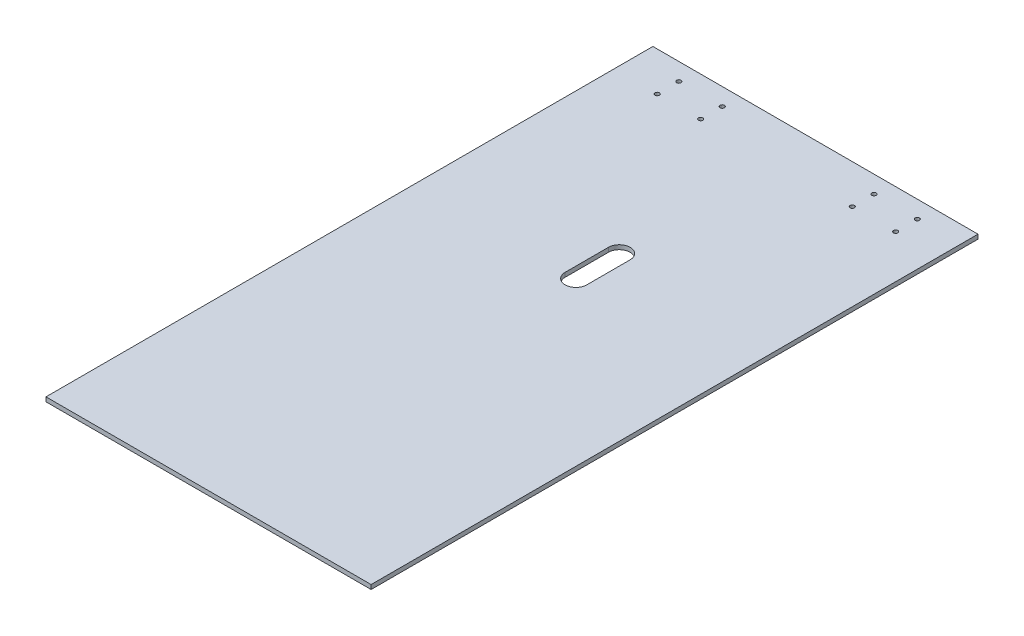
ISO-10303-21;
HEADER;
FILE_DESCRIPTION(('STEP AP214'),'2;1');
FILE_NAME('part.step','',(''),(''),'','','');
FILE_SCHEMA(('AUTOMOTIVE_DESIGN { 1 0 10303 214 1 1 1 1 }'));
ENDSEC;
DATA;
#1=APPLICATION_CONTEXT('core data for automotive mechanical design processes');
#2=APPLICATION_PROTOCOL_DEFINITION('international standard','automotive_design',2000,#1);
#3=PRODUCT_CONTEXT('',#1,'mechanical');
#4=PRODUCT('Part','Part','',(#3));
#5=PRODUCT_RELATED_PRODUCT_CATEGORY('part','',(#4));
#6=PRODUCT_DEFINITION_FORMATION('','',#4);
#7=PRODUCT_DEFINITION_CONTEXT('part definition',#1,'design');
#8=PRODUCT_DEFINITION('design','',#6,#7);
#9=PRODUCT_DEFINITION_SHAPE('','',#8);
#10=(LENGTH_UNIT() NAMED_UNIT(*) SI_UNIT(.MILLI.,.METRE.));
#11=(NAMED_UNIT(*) PLANE_ANGLE_UNIT() SI_UNIT($,.RADIAN.));
#12=(NAMED_UNIT(*) SI_UNIT($,.STERADIAN.) SOLID_ANGLE_UNIT());
#13=UNCERTAINTY_MEASURE_WITH_UNIT(LENGTH_MEASURE(1.E-05),#10,'distance_accuracy_value','');
#14=(GEOMETRIC_REPRESENTATION_CONTEXT(3) GLOBAL_UNCERTAINTY_ASSIGNED_CONTEXT((#13)) GLOBAL_UNIT_ASSIGNED_CONTEXT((#10,
#11,#12)) REPRESENTATION_CONTEXT('',''));
#15=CARTESIAN_POINT('',(0.,0.,0.));
#16=DIRECTION('',(0.,0.,1.));
#17=DIRECTION('',(1.,0.,0.));
#18=AXIS2_PLACEMENT_3D('',#15,#16,#17);
#19=CARTESIAN_POINT('',(-35.,-0.00100000000000013,-122.));
#20=DIRECTION('',(0.,1.,0.));
#21=DIRECTION('',(0.,0.,1.));
#22=AXIS2_PLACEMENT_3D('',#19,#20,#21);
#23=CYLINDRICAL_SURFACE('',#22,0.999999999999998);
#24=CARTESIAN_POINT('',(-35.,2.,-122.));
#25=DIRECTION('',(0.,1.,0.));
#26=DIRECTION('',(0.,0.,1.));
#27=AXIS2_PLACEMENT_3D('',#24,#25,#26);
#28=CIRCLE('',#27,0.999999999999998);
#29=CARTESIAN_POINT('',(-35.,2.,-121.));
#30=VERTEX_POINT('',#29);
#31=EDGE_CURVE('E198',#30,#30,#28,.T.);
#32=ORIENTED_EDGE('',*,*,#31,.T.);
#33=EDGE_LOOP('',(#32));
#34=FACE_BOUND('',#33,.T.);
#35=CARTESIAN_POINT('',(-35.,0.,-122.));
#36=DIRECTION('',(0.,1.,0.));
#37=DIRECTION('',(0.,0.,1.));
#38=AXIS2_PLACEMENT_3D('',#35,#36,#37);
#39=CIRCLE('',#38,0.999999999999998);
#40=CARTESIAN_POINT('',(-35.,0.,-121.));
#41=VERTEX_POINT('',#40);
#42=EDGE_CURVE('E201',#41,#41,#39,.F.);
#43=ORIENTED_EDGE('',*,*,#42,.T.);
#44=EDGE_LOOP('',(#43));
#45=FACE_BOUND('',#44,.T.);
#46=ADVANCED_FACE('F34',(#34,#45),#23,.F.);
#47=CARTESIAN_POINT('',(-55.,-0.00100000000000013,-122.));
#48=DIRECTION('',(0.,1.,0.));
#49=DIRECTION('',(0.,0.,1.));
#50=AXIS2_PLACEMENT_3D('',#47,#48,#49);
#51=CYLINDRICAL_SURFACE('',#50,0.999999999999998);
#52=CARTESIAN_POINT('',(-55.,2.,-122.));
#53=DIRECTION('',(0.,1.,0.));
#54=DIRECTION('',(0.,0.,1.));
#55=AXIS2_PLACEMENT_3D('',#52,#53,#54);
#56=CIRCLE('',#55,0.999999999999998);
#57=CARTESIAN_POINT('',(-55.,2.,-121.));
#58=VERTEX_POINT('',#57);
#59=EDGE_CURVE('E192',#58,#58,#56,.T.);
#60=ORIENTED_EDGE('',*,*,#59,.T.);
#61=EDGE_LOOP('',(#60));
#62=FACE_BOUND('',#61,.T.);
#63=CARTESIAN_POINT('',(-55.,0.,-122.));
#64=DIRECTION('',(0.,1.,0.));
#65=DIRECTION('',(0.,0.,1.));
#66=AXIS2_PLACEMENT_3D('',#63,#64,#65);
#67=CIRCLE('',#66,0.999999999999998);
#68=CARTESIAN_POINT('',(-55.,0.,-121.));
#69=VERTEX_POINT('',#68);
#70=EDGE_CURVE('E195',#69,#69,#67,.F.);
#71=ORIENTED_EDGE('',*,*,#70,.T.);
#72=EDGE_LOOP('',(#71));
#73=FACE_BOUND('',#72,.T.);
#74=ADVANCED_FACE('F227',(#62,#73),#51,.F.);
#75=CARTESIAN_POINT('',(75.,2.,-140.));
#76=DIRECTION('',(-1.,0.,0.));
#77=DIRECTION('',(0.,0.,1.));
#78=AXIS2_PLACEMENT_3D('',#75,#76,#77);
#79=PLANE('',#78);
#80=DIRECTION('',(0.,0.,-1.));
#81=VECTOR('',#80,1.);
#82=CARTESIAN_POINT('',(75.,0.,-140.));
#83=LINE('',#82,#81);
#84=CARTESIAN_POINT('',(75.,0.,140.));
#85=VERTEX_POINT('',#84);
#86=CARTESIAN_POINT('',(75.,0.,-140.));
#87=VERTEX_POINT('',#86);
#88=EDGE_CURVE('E162',#85,#87,#83,.T.);
#89=ORIENTED_EDGE('',*,*,#88,.T.);
#90=DIRECTION('',(0.,-1.,0.));
#91=VECTOR('',#90,1.);
#92=CARTESIAN_POINT('',(75.,2.,-140.));
#93=LINE('',#92,#91);
#94=CARTESIAN_POINT('',(75.,2.,-140.));
#95=VERTEX_POINT('',#94);
#96=EDGE_CURVE('E189',#95,#87,#93,.T.);
#97=ORIENTED_EDGE('',*,*,#96,.F.);
#98=DIRECTION('',(0.,0.,-1.));
#99=VECTOR('',#98,1.);
#100=CARTESIAN_POINT('',(75.,2.,-140.));
#101=LINE('',#100,#99);
#102=CARTESIAN_POINT('',(75.,2.,140.));
#103=VERTEX_POINT('',#102);
#104=EDGE_CURVE('E163',#103,#95,#101,.T.);
#105=ORIENTED_EDGE('',*,*,#104,.F.);
#106=DIRECTION('',(0.,-1.,0.));
#107=VECTOR('',#106,1.);
#108=CARTESIAN_POINT('',(75.,2.,140.));
#109=LINE('',#108,#107);
#110=EDGE_CURVE('E173',#103,#85,#109,.T.);
#111=ORIENTED_EDGE('',*,*,#110,.T.);
#112=EDGE_LOOP('',(#89,#97,#105,#111));
#113=FACE_BOUND('',#112,.T.);
#114=ADVANCED_FACE('F232',(#113),#79,.F.);
#115=CARTESIAN_POINT('',(-75.,2.,-140.));
#116=DIRECTION('',(0.,0.,1.));
#117=DIRECTION('',(1.,0.,0.));
#118=AXIS2_PLACEMENT_3D('',#115,#116,#117);
#119=PLANE('',#118);
#120=DIRECTION('',(-1.,0.,0.));
#121=VECTOR('',#120,1.);
#122=CARTESIAN_POINT('',(-75.,0.,-140.));
#123=LINE('',#122,#121);
#124=CARTESIAN_POINT('',(-75.,0.,-140.));
#125=VERTEX_POINT('',#124);
#126=EDGE_CURVE('E176',#87,#125,#123,.T.);
#127=ORIENTED_EDGE('',*,*,#126,.T.);
#128=DIRECTION('',(0.,-1.,0.));
#129=VECTOR('',#128,1.);
#130=CARTESIAN_POINT('',(-75.,2.,-140.));
#131=LINE('',#130,#129);
#132=CARTESIAN_POINT('',(-75.,2.,-140.));
#133=VERTEX_POINT('',#132);
#134=EDGE_CURVE('E186',#133,#125,#131,.T.);
#135=ORIENTED_EDGE('',*,*,#134,.F.);
#136=DIRECTION('',(-1.,0.,0.));
#137=VECTOR('',#136,1.);
#138=CARTESIAN_POINT('',(-75.,2.,-140.));
#139=LINE('',#138,#137);
#140=EDGE_CURVE('E166',#95,#133,#139,.T.);
#141=ORIENTED_EDGE('',*,*,#140,.F.);
#142=ORIENTED_EDGE('',*,*,#96,.T.);
#143=EDGE_LOOP('',(#127,#135,#141,#142));
#144=FACE_BOUND('',#143,.T.);
#145=ADVANCED_FACE('F257',(#144),#119,.F.);
#146=CARTESIAN_POINT('',(-75.,2.,-140.));
#147=DIRECTION('',(1.,0.,0.));
#148=DIRECTION('',(0.,0.,-1.));
#149=AXIS2_PLACEMENT_3D('',#146,#147,#148);
#150=PLANE('',#149);
#151=DIRECTION('',(0.,0.,1.));
#152=VECTOR('',#151,1.);
#153=CARTESIAN_POINT('',(-75.,0.,-140.));
#154=LINE('',#153,#152);
#155=CARTESIAN_POINT('',(-75.,0.,140.));
#156=VERTEX_POINT('',#155);
#157=EDGE_CURVE('E178',#125,#156,#154,.T.);
#158=ORIENTED_EDGE('',*,*,#157,.T.);
#159=DIRECTION('',(0.,-1.,0.));
#160=VECTOR('',#159,1.);
#161=CARTESIAN_POINT('',(-75.,2.,140.));
#162=LINE('',#161,#160);
#163=CARTESIAN_POINT('',(-75.,2.,140.));
#164=VERTEX_POINT('',#163);
#165=EDGE_CURVE('E183',#164,#156,#162,.T.);
#166=ORIENTED_EDGE('',*,*,#165,.F.);
#167=DIRECTION('',(0.,0.,1.));
#168=VECTOR('',#167,1.);
#169=CARTESIAN_POINT('',(-75.,2.,-140.));
#170=LINE('',#169,#168);
#171=EDGE_CURVE('E169',#133,#164,#170,.T.);
#172=ORIENTED_EDGE('',*,*,#171,.F.);
#173=ORIENTED_EDGE('',*,*,#134,.T.);
#174=EDGE_LOOP('',(#158,#166,#172,#173));
#175=FACE_BOUND('',#174,.T.);
#176=ADVANCED_FACE('F253',(#175),#150,.F.);
#177=CARTESIAN_POINT('',(-75.,2.,140.));
#178=DIRECTION('',(0.,0.,-1.));
#179=DIRECTION('',(-1.,0.,0.));
#180=AXIS2_PLACEMENT_3D('',#177,#178,#179);
#181=PLANE('',#180);
#182=DIRECTION('',(1.,0.,0.));
#183=VECTOR('',#182,1.);
#184=CARTESIAN_POINT('',(-75.,0.,140.));
#185=LINE('',#184,#183);
#186=EDGE_CURVE('E167',#156,#85,#185,.T.);
#187=ORIENTED_EDGE('',*,*,#186,.T.);
#188=ORIENTED_EDGE('',*,*,#110,.F.);
#189=DIRECTION('',(1.,0.,0.));
#190=VECTOR('',#189,1.);
#191=CARTESIAN_POINT('',(-75.,2.,140.));
#192=LINE('',#191,#190);
#193=EDGE_CURVE('E171',#164,#103,#192,.T.);
#194=ORIENTED_EDGE('',*,*,#193,.F.);
#195=ORIENTED_EDGE('',*,*,#165,.T.);
#196=EDGE_LOOP('',(#187,#188,#194,#195));
#197=FACE_BOUND('',#196,.T.);
#198=ADVANCED_FACE('F248',(#197),#181,.F.);
#199=CARTESIAN_POINT('',(0.,2.,0.));
#200=DIRECTION('',(0.,1.,0.));
#201=DIRECTION('',(0.,0.,1.));
#202=AXIS2_PLACEMENT_3D('',#199,#200,#201);
#203=PLANE('',#202);
#204=CARTESIAN_POINT('',(0.,2.,-29.5));
#205=DIRECTION('',(0.,1.,0.));
#206=DIRECTION('',(0.,0.,1.));
#207=AXIS2_PLACEMENT_3D('',#204,#205,#206);
#208=CIRCLE('',#207,5.);
#209=CARTESIAN_POINT('',(-4.99999999999995,2.,-29.5));
#210=VERTEX_POINT('',#209);
#211=CARTESIAN_POINT('',(5.00000000000005,2.,-29.5));
#212=VERTEX_POINT('',#211);
#213=EDGE_CURVE('E48',#210,#212,#208,.T.);
#214=ORIENTED_EDGE('',*,*,#213,.F.);
#215=DIRECTION('',(0.,0.,1.));
#216=VECTOR('',#215,1.);
#217=CARTESIAN_POINT('',(-4.99999999999996,2.,-49.5));
#218=LINE('',#217,#216);
#219=CARTESIAN_POINT('',(-4.99999999999996,2.,-49.5));
#220=VERTEX_POINT('',#219);
#221=EDGE_CURVE('E117',#220,#210,#218,.T.);
#222=ORIENTED_EDGE('',*,*,#221,.F.);
#223=CARTESIAN_POINT('',(0.,2.,-49.5));
#224=DIRECTION('',(0.,1.,0.));
#225=DIRECTION('',(0.,0.,1.));
#226=AXIS2_PLACEMENT_3D('',#223,#224,#225);
#227=CIRCLE('',#226,5.);
#228=CARTESIAN_POINT('',(5.00000000000004,2.,-49.5));
#229=VERTEX_POINT('',#228);
#230=EDGE_CURVE('E101',#229,#220,#227,.T.);
#231=ORIENTED_EDGE('',*,*,#230,.F.);
#232=DIRECTION('',(0.,0.,-1.));
#233=VECTOR('',#232,1.);
#234=CARTESIAN_POINT('',(5.00000000000004,2.,-49.5));
#235=LINE('',#234,#233);
#236=EDGE_CURVE('E110',#212,#229,#235,.T.);
#237=ORIENTED_EDGE('',*,*,#236,.F.);
#238=EDGE_LOOP('',(#214,#222,#231,#237));
#239=FACE_BOUND('',#238,.T.);
#240=CARTESIAN_POINT('',(35.,2.,-132.));
#241=DIRECTION('',(0.,-1.,0.));
#242=DIRECTION('',(0.,0.,1.));
#243=AXIS2_PLACEMENT_3D('',#240,#241,#242);
#244=CIRCLE('',#243,0.999999999999998);
#245=CARTESIAN_POINT('',(35.,2.,-131.));
#246=VERTEX_POINT('',#245);
#247=EDGE_CURVE('E127',#246,#246,#244,.T.);
#248=ORIENTED_EDGE('',*,*,#247,.T.);
#249=EDGE_LOOP('',(#248));
#250=FACE_BOUND('',#249,.T.);
#251=CARTESIAN_POINT('',(35.,2.,-122.));
#252=DIRECTION('',(0.,-1.,0.));
#253=DIRECTION('',(0.,0.,1.));
#254=AXIS2_PLACEMENT_3D('',#251,#252,#253);
#255=CIRCLE('',#254,0.999999999999998);
#256=CARTESIAN_POINT('',(35.,2.,-121.));
#257=VERTEX_POINT('',#256);
#258=EDGE_CURVE('E134',#257,#257,#255,.T.);
#259=ORIENTED_EDGE('',*,*,#258,.T.);
#260=EDGE_LOOP('',(#259));
#261=FACE_BOUND('',#260,.T.);
#262=CARTESIAN_POINT('',(55.,2.,-122.));
#263=DIRECTION('',(0.,-1.,0.));
#264=DIRECTION('',(0.,0.,1.));
#265=AXIS2_PLACEMENT_3D('',#262,#263,#264);
#266=CIRCLE('',#265,0.999999999999998);
#267=CARTESIAN_POINT('',(55.,2.,-121.));
#268=VERTEX_POINT('',#267);
#269=EDGE_CURVE('E139',#268,#268,#266,.T.);
#270=ORIENTED_EDGE('',*,*,#269,.T.);
#271=EDGE_LOOP('',(#270));
#272=FACE_BOUND('',#271,.T.);
#273=CARTESIAN_POINT('',(55.,2.,-132.));
#274=DIRECTION('',(0.,-1.,0.));
#275=DIRECTION('',(0.,0.,1.));
#276=AXIS2_PLACEMENT_3D('',#273,#274,#275);
#277=CIRCLE('',#276,0.999999999999998);
#278=CARTESIAN_POINT('',(55.,2.,-131.));
#279=VERTEX_POINT('',#278);
#280=EDGE_CURVE('E145',#279,#279,#277,.T.);
#281=ORIENTED_EDGE('',*,*,#280,.T.);
#282=EDGE_LOOP('',(#281));
#283=FACE_BOUND('',#282,.T.);
#284=CARTESIAN_POINT('',(-35.,2.,-132.));
#285=DIRECTION('',(0.,1.,0.));
#286=DIRECTION('',(0.,0.,1.));
#287=AXIS2_PLACEMENT_3D('',#284,#285,#286);
#288=CIRCLE('',#287,0.999999999999998);
#289=CARTESIAN_POINT('',(-35.,2.,-131.));
#290=VERTEX_POINT('',#289);
#291=EDGE_CURVE('E148',#290,#290,#288,.T.);
#292=ORIENTED_EDGE('',*,*,#291,.F.);
#293=EDGE_LOOP('',(#292));
#294=FACE_BOUND('',#293,.T.);
#295=CARTESIAN_POINT('',(-55.,2.,-132.));
#296=DIRECTION('',(0.,1.,0.));
#297=DIRECTION('',(0.,0.,1.));
#298=AXIS2_PLACEMENT_3D('',#295,#296,#297);
#299=CIRCLE('',#298,0.999999999999998);
#300=CARTESIAN_POINT('',(-55.,2.,-131.));
#301=VERTEX_POINT('',#300);
#302=EDGE_CURVE('E156',#301,#301,#299,.T.);
#303=ORIENTED_EDGE('',*,*,#302,.F.);
#304=EDGE_LOOP('',(#303));
#305=FACE_BOUND('',#304,.T.);
#306=ORIENTED_EDGE('',*,*,#104,.T.);
#307=ORIENTED_EDGE('',*,*,#140,.T.);
#308=ORIENTED_EDGE('',*,*,#171,.T.);
#309=ORIENTED_EDGE('',*,*,#193,.T.);
#310=EDGE_LOOP('',(#306,#307,#308,#309));
#311=FACE_BOUND('',#310,.T.);
#312=ORIENTED_EDGE('',*,*,#59,.F.);
#313=EDGE_LOOP('',(#312));
#314=FACE_BOUND('',#313,.T.);
#315=ORIENTED_EDGE('',*,*,#31,.F.);
#316=EDGE_LOOP('',(#315));
#317=FACE_BOUND('',#316,.T.);
#318=ADVANCED_FACE('F114',(#239,#250,#261,#272,#283,#294,#305,#311,#314,#317),#203,.T.);
#319=CARTESIAN_POINT('',(0.,0.,0.));
#320=DIRECTION('',(0.,1.,0.));
#321=DIRECTION('',(0.,0.,1.));
#322=AXIS2_PLACEMENT_3D('',#319,#320,#321);
#323=PLANE('',#322);
#324=DIRECTION('',(0.,0.,1.));
#325=VECTOR('',#324,1.);
#326=CARTESIAN_POINT('',(-4.99999999999995,0.,0.));
#327=LINE('',#326,#325);
#328=CARTESIAN_POINT('',(-4.99999999999996,0.,-49.5));
#329=VERTEX_POINT('',#328);
#330=CARTESIAN_POINT('',(-4.99999999999995,0.,-29.5));
#331=VERTEX_POINT('',#330);
#332=EDGE_CURVE('E41',#329,#331,#327,.T.);
#333=ORIENTED_EDGE('',*,*,#332,.T.);
#334=CARTESIAN_POINT('',(0.,0.,-29.5));
#335=DIRECTION('',(0.,1.,0.));
#336=DIRECTION('',(0.,0.,1.));
#337=AXIS2_PLACEMENT_3D('',#334,#335,#336);
#338=CIRCLE('',#337,5.);
#339=CARTESIAN_POINT('',(5.00000000000005,0.,-29.5));
#340=VERTEX_POINT('',#339);
#341=EDGE_CURVE('E11',#331,#340,#338,.T.);
#342=ORIENTED_EDGE('',*,*,#341,.T.);
#343=DIRECTION('',(0.,0.,-1.));
#344=VECTOR('',#343,1.);
#345=CARTESIAN_POINT('',(5.00000000000006,0.,0.));
#346=LINE('',#345,#344);
#347=CARTESIAN_POINT('',(5.00000000000004,0.,-49.5));
#348=VERTEX_POINT('',#347);
#349=EDGE_CURVE('E204',#340,#348,#346,.T.);
#350=ORIENTED_EDGE('',*,*,#349,.T.);
#351=CARTESIAN_POINT('',(0.,0.,-49.5));
#352=DIRECTION('',(0.,1.,0.));
#353=DIRECTION('',(0.,0.,1.));
#354=AXIS2_PLACEMENT_3D('',#351,#352,#353);
#355=CIRCLE('',#354,5.);
#356=EDGE_CURVE('E104',#348,#329,#355,.T.);
#357=ORIENTED_EDGE('',*,*,#356,.T.);
#358=EDGE_LOOP('',(#333,#342,#350,#357));
#359=FACE_BOUND('',#358,.T.);
#360=CARTESIAN_POINT('',(35.,0.,-132.));
#361=DIRECTION('',(0.,1.,0.));
#362=DIRECTION('',(0.,0.,1.));
#363=AXIS2_PLACEMENT_3D('',#360,#361,#362);
#364=CIRCLE('',#363,0.999999999999998);
#365=CARTESIAN_POINT('',(35.,0.,-131.));
#366=VERTEX_POINT('',#365);
#367=EDGE_CURVE('E131',#366,#366,#364,.T.);
#368=ORIENTED_EDGE('',*,*,#367,.T.);
#369=EDGE_LOOP('',(#368));
#370=FACE_BOUND('',#369,.T.);
#371=CARTESIAN_POINT('',(35.,0.,-122.));
#372=DIRECTION('',(0.,1.,0.));
#373=DIRECTION('',(0.,0.,1.));
#374=AXIS2_PLACEMENT_3D('',#371,#372,#373);
#375=CIRCLE('',#374,0.999999999999998);
#376=CARTESIAN_POINT('',(35.,0.,-121.));
#377=VERTEX_POINT('',#376);
#378=EDGE_CURVE('E124',#377,#377,#375,.T.);
#379=ORIENTED_EDGE('',*,*,#378,.T.);
#380=EDGE_LOOP('',(#379));
#381=FACE_BOUND('',#380,.T.);
#382=CARTESIAN_POINT('',(55.,0.,-122.));
#383=DIRECTION('',(0.,1.,0.));
#384=DIRECTION('',(0.,0.,1.));
#385=AXIS2_PLACEMENT_3D('',#382,#383,#384);
#386=CIRCLE('',#385,0.999999999999998);
#387=CARTESIAN_POINT('',(55.,0.,-121.));
#388=VERTEX_POINT('',#387);
#389=EDGE_CURVE('E130',#388,#388,#386,.T.);
#390=ORIENTED_EDGE('',*,*,#389,.T.);
#391=EDGE_LOOP('',(#390));
#392=FACE_BOUND('',#391,.T.);
#393=CARTESIAN_POINT('',(55.,0.,-132.));
#394=DIRECTION('',(0.,1.,0.));
#395=DIRECTION('',(0.,0.,1.));
#396=AXIS2_PLACEMENT_3D('',#393,#394,#395);
#397=CIRCLE('',#396,0.999999999999998);
#398=CARTESIAN_POINT('',(55.,0.,-131.));
#399=VERTEX_POINT('',#398);
#400=EDGE_CURVE('E142',#399,#399,#397,.T.);
#401=ORIENTED_EDGE('',*,*,#400,.T.);
#402=EDGE_LOOP('',(#401));
#403=FACE_BOUND('',#402,.T.);
#404=CARTESIAN_POINT('',(-35.,0.,-132.));
#405=DIRECTION('',(0.,1.,0.));
#406=DIRECTION('',(0.,0.,1.));
#407=AXIS2_PLACEMENT_3D('',#404,#405,#406);
#408=CIRCLE('',#407,0.999999999999998);
#409=CARTESIAN_POINT('',(-35.,0.,-131.));
#410=VERTEX_POINT('',#409);
#411=EDGE_CURVE('E153',#410,#410,#408,.F.);
#412=ORIENTED_EDGE('',*,*,#411,.F.);
#413=EDGE_LOOP('',(#412));
#414=FACE_BOUND('',#413,.T.);
#415=CARTESIAN_POINT('',(-55.,0.,-132.));
#416=DIRECTION('',(0.,1.,0.));
#417=DIRECTION('',(0.,0.,1.));
#418=AXIS2_PLACEMENT_3D('',#415,#416,#417);
#419=CIRCLE('',#418,0.999999999999998);
#420=CARTESIAN_POINT('',(-55.,0.,-131.));
#421=VERTEX_POINT('',#420);
#422=EDGE_CURVE('E159',#421,#421,#419,.F.);
#423=ORIENTED_EDGE('',*,*,#422,.F.);
#424=EDGE_LOOP('',(#423));
#425=FACE_BOUND('',#424,.T.);
#426=ORIENTED_EDGE('',*,*,#88,.F.);
#427=ORIENTED_EDGE('',*,*,#186,.F.);
#428=ORIENTED_EDGE('',*,*,#157,.F.);
#429=ORIENTED_EDGE('',*,*,#126,.F.);
#430=EDGE_LOOP('',(#426,#427,#428,#429));
#431=FACE_BOUND('',#430,.T.);
#432=ORIENTED_EDGE('',*,*,#70,.F.);
#433=EDGE_LOOP('',(#432));
#434=FACE_BOUND('',#433,.T.);
#435=ORIENTED_EDGE('',*,*,#42,.F.);
#436=EDGE_LOOP('',(#435));
#437=FACE_BOUND('',#436,.T.);
#438=ADVANCED_FACE('F208',(#359,#370,#381,#392,#403,#414,#425,#431,#434,#437),#323,.F.);
#439=CARTESIAN_POINT('',(-55.,-0.00100000000000013,-132.));
#440=DIRECTION('',(0.,1.,0.));
#441=DIRECTION('',(0.,0.,1.));
#442=AXIS2_PLACEMENT_3D('',#439,#440,#441);
#443=CYLINDRICAL_SURFACE('',#442,0.999999999999998);
#444=ORIENTED_EDGE('',*,*,#302,.T.);
#445=EDGE_LOOP('',(#444));
#446=FACE_BOUND('',#445,.T.);
#447=ORIENTED_EDGE('',*,*,#422,.T.);
#448=EDGE_LOOP('',(#447));
#449=FACE_BOUND('',#448,.T.);
#450=ADVANCED_FACE('F239',(#446,#449),#443,.F.);
#451=CARTESIAN_POINT('',(-35.,-0.00100000000000013,-132.));
#452=DIRECTION('',(0.,1.,0.));
#453=DIRECTION('',(0.,0.,1.));
#454=AXIS2_PLACEMENT_3D('',#451,#452,#453);
#455=CYLINDRICAL_SURFACE('',#454,0.999999999999998);
#456=ORIENTED_EDGE('',*,*,#291,.T.);
#457=EDGE_LOOP('',(#456));
#458=FACE_BOUND('',#457,.T.);
#459=ORIENTED_EDGE('',*,*,#411,.T.);
#460=EDGE_LOOP('',(#459));
#461=FACE_BOUND('',#460,.T.);
#462=ADVANCED_FACE('F245',(#458,#461),#455,.F.);
#463=CARTESIAN_POINT('',(55.,-0.00100000000000013,-132.));
#464=DIRECTION('',(0.,1.,0.));
#465=DIRECTION('',(0.,0.,1.));
#466=AXIS2_PLACEMENT_3D('',#463,#464,#465);
#467=CYLINDRICAL_SURFACE('',#466,0.999999999999998);
#468=ORIENTED_EDGE('',*,*,#280,.F.);
#469=EDGE_LOOP('',(#468));
#470=FACE_BOUND('',#469,.T.);
#471=ORIENTED_EDGE('',*,*,#400,.F.);
#472=EDGE_LOOP('',(#471));
#473=FACE_BOUND('',#472,.T.);
#474=ADVANCED_FACE('F357',(#470,#473),#467,.F.);
#475=CARTESIAN_POINT('',(55.,-0.00100000000000013,-122.));
#476=DIRECTION('',(0.,1.,0.));
#477=DIRECTION('',(0.,0.,1.));
#478=AXIS2_PLACEMENT_3D('',#475,#476,#477);
#479=CYLINDRICAL_SURFACE('',#478,0.999999999999998);
#480=ORIENTED_EDGE('',*,*,#269,.F.);
#481=EDGE_LOOP('',(#480));
#482=FACE_BOUND('',#481,.T.);
#483=ORIENTED_EDGE('',*,*,#389,.F.);
#484=EDGE_LOOP('',(#483));
#485=FACE_BOUND('',#484,.T.);
#486=ADVANCED_FACE('F348',(#482,#485),#479,.F.);
#487=CARTESIAN_POINT('',(35.,-0.00100000000000013,-122.));
#488=DIRECTION('',(0.,1.,0.));
#489=DIRECTION('',(0.,0.,1.));
#490=AXIS2_PLACEMENT_3D('',#487,#488,#489);
#491=CYLINDRICAL_SURFACE('',#490,0.999999999999998);
#492=ORIENTED_EDGE('',*,*,#258,.F.);
#493=EDGE_LOOP('',(#492));
#494=FACE_BOUND('',#493,.T.);
#495=ORIENTED_EDGE('',*,*,#378,.F.);
#496=EDGE_LOOP('',(#495));
#497=FACE_BOUND('',#496,.T.);
#498=ADVANCED_FACE('F222',(#494,#497),#491,.F.);
#499=CARTESIAN_POINT('',(35.,-0.00100000000000013,-132.));
#500=DIRECTION('',(0.,1.,0.));
#501=DIRECTION('',(0.,0.,1.));
#502=AXIS2_PLACEMENT_3D('',#499,#500,#501);
#503=CYLINDRICAL_SURFACE('',#502,0.999999999999998);
#504=ORIENTED_EDGE('',*,*,#247,.F.);
#505=EDGE_LOOP('',(#504));
#506=FACE_BOUND('',#505,.T.);
#507=ORIENTED_EDGE('',*,*,#367,.F.);
#508=EDGE_LOOP('',(#507));
#509=FACE_BOUND('',#508,.T.);
#510=ADVANCED_FACE('F215',(#506,#509),#503,.F.);
#511=CARTESIAN_POINT('',(0.,-8.,-29.5));
#512=DIRECTION('',(0.,1.,0.));
#513=DIRECTION('',(0.,0.,1.));
#514=AXIS2_PLACEMENT_3D('',#511,#512,#513);
#515=CYLINDRICAL_SURFACE('',#514,5.);
#516=DIRECTION('',(0.,1.,0.));
#517=VECTOR('',#516,1.);
#518=CARTESIAN_POINT('',(-4.99999999999995,-8.,-29.5));
#519=LINE('',#518,#517);
#520=EDGE_CURVE('E122',#331,#210,#519,.T.);
#521=ORIENTED_EDGE('',*,*,#520,.T.);
#522=ORIENTED_EDGE('',*,*,#213,.T.);
#523=DIRECTION('',(0.,1.,0.));
#524=VECTOR('',#523,1.);
#525=CARTESIAN_POINT('',(5.00000000000005,-8.,-29.5));
#526=LINE('',#525,#524);
#527=EDGE_CURVE('E107',#340,#212,#526,.T.);
#528=ORIENTED_EDGE('',*,*,#527,.F.);
#529=ORIENTED_EDGE('',*,*,#341,.F.);
#530=EDGE_LOOP('',(#521,#522,#528,#529));
#531=FACE_BOUND('',#530,.T.);
#532=ADVANCED_FACE('F213',(#531),#515,.F.);
#533=CARTESIAN_POINT('',(-4.99999999999996,-8.,-49.5));
#534=DIRECTION('',(-1.,0.,0.));
#535=DIRECTION('',(0.,0.,1.));
#536=AXIS2_PLACEMENT_3D('',#533,#534,#535);
#537=PLANE('',#536);
#538=DIRECTION('',(0.,1.,0.));
#539=VECTOR('',#538,1.);
#540=CARTESIAN_POINT('',(-4.99999999999996,-8.,-49.5));
#541=LINE('',#540,#539);
#542=EDGE_CURVE('E106',#329,#220,#541,.T.);
#543=ORIENTED_EDGE('',*,*,#542,.T.);
#544=ORIENTED_EDGE('',*,*,#221,.T.);
#545=ORIENTED_EDGE('',*,*,#520,.F.);
#546=ORIENTED_EDGE('',*,*,#332,.F.);
#547=EDGE_LOOP('',(#543,#544,#545,#546));
#548=FACE_BOUND('',#547,.T.);
#549=ADVANCED_FACE('F212',(#548),#537,.F.);
#550=CARTESIAN_POINT('',(0.,-8.,-49.5));
#551=DIRECTION('',(0.,1.,0.));
#552=DIRECTION('',(0.,0.,1.));
#553=AXIS2_PLACEMENT_3D('',#550,#551,#552);
#554=CYLINDRICAL_SURFACE('',#553,5.);
#555=DIRECTION('',(0.,1.,0.));
#556=VECTOR('',#555,1.);
#557=CARTESIAN_POINT('',(5.00000000000004,-8.,-49.5));
#558=LINE('',#557,#556);
#559=EDGE_CURVE('E56',#348,#229,#558,.T.);
#560=ORIENTED_EDGE('',*,*,#559,.T.);
#561=ORIENTED_EDGE('',*,*,#230,.T.);
#562=ORIENTED_EDGE('',*,*,#542,.F.);
#563=ORIENTED_EDGE('',*,*,#356,.F.);
#564=EDGE_LOOP('',(#560,#561,#562,#563));
#565=FACE_BOUND('',#564,.T.);
#566=ADVANCED_FACE('F98',(#565),#554,.F.);
#567=CARTESIAN_POINT('',(5.00000000000004,-8.,-49.5));
#568=DIRECTION('',(1.,0.,0.));
#569=DIRECTION('',(0.,0.,-1.));
#570=AXIS2_PLACEMENT_3D('',#567,#568,#569);
#571=PLANE('',#570);
#572=ORIENTED_EDGE('',*,*,#527,.T.);
#573=ORIENTED_EDGE('',*,*,#236,.T.);
#574=ORIENTED_EDGE('',*,*,#559,.F.);
#575=ORIENTED_EDGE('',*,*,#349,.F.);
#576=EDGE_LOOP('',(#572,#573,#574,#575));
#577=FACE_BOUND('',#576,.T.);
#578=ADVANCED_FACE('F111',(#577),#571,.F.);
#579=CLOSED_SHELL('',(#46,#74,#114,#145,#176,#198,#318,#438,#450,#462,#474,#486,#498,#510,#532,
#549,#566,#578));
#580=MANIFOLD_SOLID_BREP('B2',#579);
#581=ADVANCED_BREP_SHAPE_REPRESENTATION('',(#18,#580),#14);
#582=SHAPE_DEFINITION_REPRESENTATION(#9,#581);
ENDSEC;
END-ISO-10303-21;
